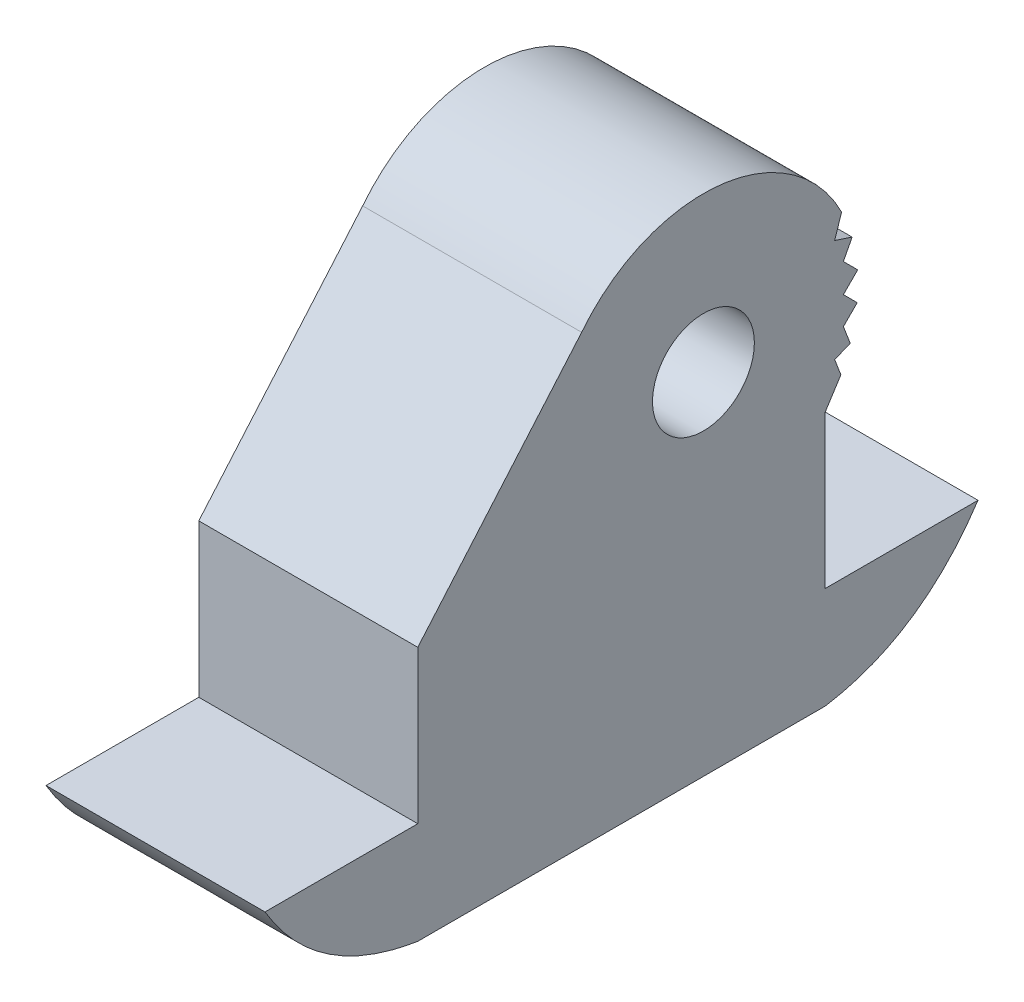
ISO-10303-21;
HEADER;
FILE_DESCRIPTION(('STEP AP214'),'2;1');
FILE_NAME('part.step','',(''),(''),'','','');
FILE_SCHEMA(('AUTOMOTIVE_DESIGN { 1 0 10303 214 1 1 1 1 }'));
ENDSEC;
DATA;
#1=APPLICATION_CONTEXT('core data for automotive mechanical design processes');
#2=APPLICATION_PROTOCOL_DEFINITION('international standard','automotive_design',2000,#1);
#3=PRODUCT_CONTEXT('',#1,'mechanical');
#4=PRODUCT('Part','Part','',(#3));
#5=PRODUCT_RELATED_PRODUCT_CATEGORY('part','',(#4));
#6=PRODUCT_DEFINITION_FORMATION('','',#4);
#7=PRODUCT_DEFINITION_CONTEXT('part definition',#1,'design');
#8=PRODUCT_DEFINITION('design','',#6,#7);
#9=PRODUCT_DEFINITION_SHAPE('','',#8);
#10=(LENGTH_UNIT() NAMED_UNIT(*) SI_UNIT(.MILLI.,.METRE.));
#11=(NAMED_UNIT(*) PLANE_ANGLE_UNIT() SI_UNIT($,.RADIAN.));
#12=(NAMED_UNIT(*) SI_UNIT($,.STERADIAN.) SOLID_ANGLE_UNIT());
#13=UNCERTAINTY_MEASURE_WITH_UNIT(LENGTH_MEASURE(1.E-05),#10,'distance_accuracy_value','');
#14=(GEOMETRIC_REPRESENTATION_CONTEXT(3) GLOBAL_UNCERTAINTY_ASSIGNED_CONTEXT((#13)) GLOBAL_UNIT_ASSIGNED_CONTEXT((#10,
#11,#12)) REPRESENTATION_CONTEXT('',''));
#15=CARTESIAN_POINT('',(0.,0.,0.));
#16=DIRECTION('',(0.,0.,1.));
#17=DIRECTION('',(1.,0.,0.));
#18=AXIS2_PLACEMENT_3D('',#15,#16,#17);
#19=CARTESIAN_POINT('',(-2.15,5.,-4.));
#20=DIRECTION('',(0.,0.,1.));
#21=DIRECTION('',(1.,0.,0.));
#22=AXIS2_PLACEMENT_3D('',#19,#20,#21);
#23=PLANE('',#22);
#24=DIRECTION('',(1.,0.,0.));
#25=VECTOR('',#24,1.);
#26=CARTESIAN_POINT('',(-5.75555127546399,2.,-4.));
#27=LINE('',#26,#25);
#28=CARTESIAN_POINT('',(-2.15,2.,-4.));
#29=VERTEX_POINT('',#28);
#30=CARTESIAN_POINT('',(2.15,2.,-4.));
#31=VERTEX_POINT('',#30);
#32=EDGE_CURVE('E55',#29,#31,#27,.T.);
#33=ORIENTED_EDGE('',*,*,#32,.F.);
#34=DIRECTION('',(0.,-1.,0.));
#35=VECTOR('',#34,1.);
#36=CARTESIAN_POINT('',(-2.15,5.,-4.));
#37=LINE('',#36,#35);
#38=CARTESIAN_POINT('',(-2.15,5.,-4.));
#39=VERTEX_POINT('',#38);
#40=EDGE_CURVE('E49',#39,#29,#37,.T.);
#41=ORIENTED_EDGE('',*,*,#40,.F.);
#42=DIRECTION('',(-1.,0.,0.));
#43=VECTOR('',#42,1.);
#44=CARTESIAN_POINT('',(-2.15,5.,-4.));
#45=LINE('',#44,#43);
#46=CARTESIAN_POINT('',(2.15,5.,-4.));
#47=VERTEX_POINT('',#46);
#48=EDGE_CURVE('E341',#47,#39,#45,.T.);
#49=ORIENTED_EDGE('',*,*,#48,.F.);
#50=DIRECTION('',(0.,-1.,0.));
#51=VECTOR('',#50,1.);
#52=CARTESIAN_POINT('',(2.15,5.,-4.));
#53=LINE('',#52,#51);
#54=EDGE_CURVE('E11',#47,#31,#53,.T.);
#55=ORIENTED_EDGE('',*,*,#54,.T.);
#56=EDGE_LOOP('',(#33,#41,#49,#55));
#57=FACE_BOUND('',#56,.T.);
#58=ADVANCED_FACE('F41',(#57),#23,.F.);
#59=CARTESIAN_POINT('',(2.15,5.,-4.));
#60=DIRECTION('',(-1.,0.,0.));
#61=DIRECTION('',(0.,0.,1.));
#62=AXIS2_PLACEMENT_3D('',#59,#60,#61);
#63=PLANE('',#62);
#64=DIRECTION('',(0.,0.,-1.));
#65=VECTOR('',#64,1.);
#66=CARTESIAN_POINT('',(2.15,0.,-4.));
#67=LINE('',#66,#65);
#68=CARTESIAN_POINT('',(2.15,0.,4.));
#69=VERTEX_POINT('',#68);
#70=CARTESIAN_POINT('',(2.15,0.,-4.));
#71=VERTEX_POINT('',#70);
#72=EDGE_CURVE('E340',#69,#71,#67,.T.);
#73=ORIENTED_EDGE('',*,*,#72,.T.);
#74=CARTESIAN_POINT('',(2.15,0.,-4.));
#75=CARTESIAN_POINT('',(2.15,0.295991092707208,-5.86881420991045));
#76=CARTESIAN_POINT('',(2.15,2.,-7.));
#77=B_SPLINE_CURVE_WITH_KNOTS('',2,(#74,#75,#76),.UNSPECIFIED.,.F.,.F.,(3,3),(0.,1.),.UNSPECIFIED.);
#78=CARTESIAN_POINT('',(2.15,2.,-7.));
#79=VERTEX_POINT('',#78);
#80=EDGE_CURVE('E280',#71,#79,#77,.T.);
#81=ORIENTED_EDGE('',*,*,#80,.T.);
#82=DIRECTION('',(0.,0.,1.));
#83=VECTOR('',#82,1.);
#84=CARTESIAN_POINT('',(2.15,2.,-4.));
#85=LINE('',#84,#83);
#86=EDGE_CURVE('E277',#79,#31,#85,.T.);
#87=ORIENTED_EDGE('',*,*,#86,.T.);
#88=ORIENTED_EDGE('',*,*,#54,.F.);
#89=DIRECTION('',(0.,0.841553339065543,-0.540174025206355));
#90=VECTOR('',#89,1.);
#91=CARTESIAN_POINT('',(2.15,5.47996911176551,-4.30808130042593));
#92=LINE('',#91,#90);
#93=CARTESIAN_POINT('',(2.15,5.47996911176551,-4.30808130042593));
#94=VERTEX_POINT('',#93);
#95=EDGE_CURVE('E184',#47,#94,#92,.T.);
#96=ORIENTED_EDGE('',*,*,#95,.T.);
#97=DIRECTION('',(0.,0.933817176744675,0.357750584089814));
#98=VECTOR('',#97,1.);
#99=CARTESIAN_POINT('',(2.15,5.80148797690143,-4.18490562464831));
#100=LINE('',#99,#98);
#101=CARTESIAN_POINT('',(2.15,5.80148797690143,-4.18490562464831));
#102=VERTEX_POINT('',#101);
#103=EDGE_CURVE('E193',#94,#102,#100,.T.);
#104=ORIENTED_EDGE('',*,*,#103,.T.);
#105=DIRECTION('',(0.,0.357750584089813,-0.933817176744676));
#106=VECTOR('',#105,1.);
#107=CARTESIAN_POINT('',(2.15,5.91948539690457,-4.49290796625408));
#108=LINE('',#107,#106);
#109=CARTESIAN_POINT('',(2.15,5.91948539690457,-4.49290796625408));
#110=VERTEX_POINT('',#109);
#111=EDGE_CURVE('E199',#102,#110,#108,.T.);
#112=ORIENTED_EDGE('',*,*,#111,.T.);
#113=DIRECTION('',(0.,0.933817176744676,0.357750584089813));
#114=VECTOR('',#113,1.);
#115=CARTESIAN_POINT('',(2.15,6.27457062281251,-4.35687282989788));
#116=LINE('',#115,#114);
#117=CARTESIAN_POINT('',(2.15,6.27457062281251,-4.35687282989788));
#118=VERTEX_POINT('',#117);
#119=EDGE_CURVE('E212',#110,#118,#116,.T.);
#120=ORIENTED_EDGE('',*,*,#119,.T.);
#121=DIRECTION('',(0.,0.706411155567094,-0.707801723147354));
#122=VECTOR('',#121,1.);
#123=CARTESIAN_POINT('',(2.15,6.54610637845833,-4.62894310261029));
#124=LINE('',#123,#122);
#125=CARTESIAN_POINT('',(2.15,6.54610637845833,-4.62894310261029));
#126=VERTEX_POINT('',#125);
#127=EDGE_CURVE('E215',#118,#126,#124,.T.);
#128=ORIENTED_EDGE('',*,*,#127,.T.);
#129=DIRECTION('',(0.,0.707801723147358,0.70641115556709));
#130=VECTOR('',#129,1.);
#131=CARTESIAN_POINT('',(2.15,6.81871222043208,-4.35687282989787));
#132=LINE('',#131,#130);
#133=CARTESIAN_POINT('',(2.15,6.81871222043208,-4.35687282989787));
#134=VERTEX_POINT('',#133);
#135=EDGE_CURVE('E218',#126,#134,#132,.T.);
#136=ORIENTED_EDGE('',*,*,#135,.T.);
#137=DIRECTION('',(0.,0.706411155567095,-0.707801723147352));
#138=VECTOR('',#137,1.);
#139=CARTESIAN_POINT('',(2.15,7.09953270220437,-4.6382461056836));
#140=LINE('',#139,#138);
#141=CARTESIAN_POINT('',(2.15,7.09953270220437,-4.6382461056836));
#142=VERTEX_POINT('',#141);
#143=EDGE_CURVE('E221',#134,#142,#140,.T.);
#144=ORIENTED_EDGE('',*,*,#143,.T.);
#145=DIRECTION('',(0.,0.707801723147357,0.70641115556709));
#146=VECTOR('',#145,1.);
#147=CARTESIAN_POINT('',(2.15,7.38145986017638,-4.35687282989787));
#148=LINE('',#147,#146);
#149=CARTESIAN_POINT('',(2.15,7.38145986017638,-4.35687282989787));
#150=VERTEX_POINT('',#149);
#151=EDGE_CURVE('E224',#142,#150,#148,.T.);
#152=ORIENTED_EDGE('',*,*,#151,.T.);
#153=DIRECTION('',(0.,0.886815065357864,-0.462124485235665));
#154=VECTOR('',#153,1.);
#155=CARTESIAN_POINT('',(2.15,7.7114642491129,-4.52884003514743));
#156=LINE('',#155,#154);
#157=CARTESIAN_POINT('',(2.15,7.7114642491129,-4.52884003514743));
#158=VERTEX_POINT('',#157);
#159=EDGE_CURVE('E227',#150,#158,#156,.T.);
#160=ORIENTED_EDGE('',*,*,#159,.T.);
#161=DIRECTION('',(0.,0.313872790344998,0.949465044896886));
#162=VECTOR('',#161,1.);
#163=CARTESIAN_POINT('',(2.15,7.8251615923687,-4.18490562464831));
#164=LINE('',#163,#162);
#165=CARTESIAN_POINT('',(2.15,7.8251615923687,-4.18490562464831));
#166=VERTEX_POINT('',#165);
#167=EDGE_CURVE('E230',#158,#166,#164,.T.);
#168=ORIENTED_EDGE('',*,*,#167,.T.);
#169=DIRECTION('',(0.,0.949465044896885,-0.313872790344998));
#170=VECTOR('',#169,1.);
#171=CARTESIAN_POINT('',(2.15,8.23998936776822,-4.32203879461288));
#172=LINE('',#171,#170);
#173=CARTESIAN_POINT('',(2.15,8.23998936776822,-4.32203879461288));
#174=VERTEX_POINT('',#173);
#175=EDGE_CURVE('E233',#166,#174,#172,.T.);
#176=ORIENTED_EDGE('',*,*,#175,.T.);
#177=CARTESIAN_POINT('',(2.15,6.87366445419573,-1.60888166582021));
#178=DIRECTION('',(1.,0.,0.));
#179=DIRECTION('',(0.,0.,1.));
#180=AXIS2_PLACEMENT_3D('',#177,#178,#179);
#181=CIRCLE('',#180,3.03777309471384);
#182=CARTESIAN_POINT('',(2.15,8.74732890839147,0.782236668359575));
#183=VERTEX_POINT('',#182);
#184=EDGE_CURVE('E236',#174,#183,#181,.T.);
#185=ORIENTED_EDGE('',*,*,#184,.T.);
#186=DIRECTION('',(0.,-0.758679369993663,0.651464207417429));
#187=VECTOR('',#186,1.);
#188=CARTESIAN_POINT('',(2.15,5.,4.));
#189=LINE('',#188,#187);
#190=CARTESIAN_POINT('',(2.15,5.,4.));
#191=VERTEX_POINT('',#190);
#192=EDGE_CURVE('E190',#183,#191,#189,.T.);
#193=ORIENTED_EDGE('',*,*,#192,.T.);
#194=DIRECTION('',(0.,-1.,0.));
#195=VECTOR('',#194,1.);
#196=CARTESIAN_POINT('',(2.15,5.,4.));
#197=LINE('',#196,#195);
#198=CARTESIAN_POINT('',(2.15,2.,4.));
#199=VERTEX_POINT('',#198);
#200=EDGE_CURVE('E347',#191,#199,#197,.T.);
#201=ORIENTED_EDGE('',*,*,#200,.T.);
#202=DIRECTION('',(0.,0.,1.));
#203=VECTOR('',#202,1.);
#204=CARTESIAN_POINT('',(2.15,2.,4.));
#205=LINE('',#204,#203);
#206=CARTESIAN_POINT('',(2.15,2.,7.));
#207=VERTEX_POINT('',#206);
#208=EDGE_CURVE('E63',#199,#207,#205,.T.);
#209=ORIENTED_EDGE('',*,*,#208,.T.);
#210=CARTESIAN_POINT('',(2.15,2.,7.));
#211=CARTESIAN_POINT('',(2.15,0.317190085835391,6.00265938488311));
#212=CARTESIAN_POINT('',(2.15,0.,4.));
#213=B_SPLINE_CURVE_WITH_KNOTS('',2,(#210,#211,#212),.UNSPECIFIED.,.F.,.F.,(3,3),(0.,1.),.UNSPECIFIED.);
#214=EDGE_CURVE('E326',#207,#69,#213,.T.);
#215=ORIENTED_EDGE('',*,*,#214,.T.);
#216=EDGE_LOOP('',(#73,#81,#87,#88,#96,#104,#112,#120,#128,#136,#144,#152,#160,#168,#176,#185,
#193,#201,#209,#215));
#217=FACE_BOUND('',#216,.T.);
#218=CARTESIAN_POINT('',(2.15,6.87366445419573,-1.60888166582021));
#219=DIRECTION('',(1.,0.,0.));
#220=DIRECTION('',(0.,0.,-1.));
#221=AXIS2_PLACEMENT_3D('',#218,#219,#220);
#222=CIRCLE('',#221,1.);
#223=CARTESIAN_POINT('',(2.15,6.87366445419573,-2.60888166582021));
#224=VERTEX_POINT('',#223);
#225=EDGE_CURVE('E205',#224,#224,#222,.T.);
#226=ORIENTED_EDGE('',*,*,#225,.F.);
#227=EDGE_LOOP('',(#226));
#228=FACE_BOUND('',#227,.T.);
#229=ADVANCED_FACE('F43',(#217,#228),#63,.F.);
#230=CARTESIAN_POINT('',(-2.15,5.,-4.));
#231=DIRECTION('',(1.,0.,0.));
#232=DIRECTION('',(0.,0.,-1.));
#233=AXIS2_PLACEMENT_3D('',#230,#231,#232);
#234=PLANE('',#233);
#235=DIRECTION('',(0.,0.,1.));
#236=VECTOR('',#235,1.);
#237=CARTESIAN_POINT('',(-2.15,0.,-4.));
#238=LINE('',#237,#236);
#239=CARTESIAN_POINT('',(-2.15,0.,-4.));
#240=VERTEX_POINT('',#239);
#241=CARTESIAN_POINT('',(-2.15,0.,4.));
#242=VERTEX_POINT('',#241);
#243=EDGE_CURVE('E352',#240,#242,#238,.T.);
#244=ORIENTED_EDGE('',*,*,#243,.T.);
#245=CARTESIAN_POINT('',(-2.15,2.,7.));
#246=CARTESIAN_POINT('',(-2.15,0.317190085835391,6.00265938488311));
#247=CARTESIAN_POINT('',(-2.15,0.,4.));
#248=B_SPLINE_CURVE_WITH_KNOTS('',2,(#245,#246,#247),.UNSPECIFIED.,.F.,.F.,(3,3),(0.,1.),.UNSPECIFIED.);
#249=CARTESIAN_POINT('',(-2.15,2.,7.));
#250=VERTEX_POINT('',#249);
#251=EDGE_CURVE('E319',#242,#250,#248,.F.);
#252=ORIENTED_EDGE('',*,*,#251,.T.);
#253=DIRECTION('',(0.,0.,-1.));
#254=VECTOR('',#253,1.);
#255=CARTESIAN_POINT('',(-2.15,2.,4.));
#256=LINE('',#255,#254);
#257=CARTESIAN_POINT('',(-2.15,2.,4.));
#258=VERTEX_POINT('',#257);
#259=EDGE_CURVE('E338',#250,#258,#256,.T.);
#260=ORIENTED_EDGE('',*,*,#259,.T.);
#261=DIRECTION('',(0.,-1.,0.));
#262=VECTOR('',#261,1.);
#263=CARTESIAN_POINT('',(-2.15,5.,4.));
#264=LINE('',#263,#262);
#265=CARTESIAN_POINT('',(-2.15,5.,4.));
#266=VERTEX_POINT('',#265);
#267=EDGE_CURVE('E358',#266,#258,#264,.T.);
#268=ORIENTED_EDGE('',*,*,#267,.F.);
#269=DIRECTION('',(0.,0.758679369993663,-0.651464207417429));
#270=VECTOR('',#269,1.);
#271=CARTESIAN_POINT('',(-2.15,5.,4.));
#272=LINE('',#271,#270);
#273=CARTESIAN_POINT('',(-2.15,8.74732890839147,0.782236668359575));
#274=VERTEX_POINT('',#273);
#275=EDGE_CURVE('E381',#266,#274,#272,.T.);
#276=ORIENTED_EDGE('',*,*,#275,.T.);
#277=CARTESIAN_POINT('',(-2.15,6.87366445419573,-1.60888166582021));
#278=DIRECTION('',(1.,0.,0.));
#279=DIRECTION('',(0.,0.,-1.));
#280=AXIS2_PLACEMENT_3D('',#277,#278,#279);
#281=CIRCLE('',#280,3.03777309471384);
#282=CARTESIAN_POINT('',(-2.15,8.23998936776822,-4.32203879461288));
#283=VERTEX_POINT('',#282);
#284=EDGE_CURVE('E383',#274,#283,#281,.F.);
#285=ORIENTED_EDGE('',*,*,#284,.T.);
#286=DIRECTION('',(0.,-0.949465044896885,0.313872790344998));
#287=VECTOR('',#286,1.);
#288=CARTESIAN_POINT('',(-2.15,8.23998936776822,-4.32203879461288));
#289=LINE('',#288,#287);
#290=CARTESIAN_POINT('',(-2.15,7.8251615923687,-4.18490562464831));
#291=VERTEX_POINT('',#290);
#292=EDGE_CURVE('E385',#283,#291,#289,.T.);
#293=ORIENTED_EDGE('',*,*,#292,.T.);
#294=DIRECTION('',(0.,-0.313872790344998,-0.949465044896886));
#295=VECTOR('',#294,1.);
#296=CARTESIAN_POINT('',(-2.15,7.8251615923687,-4.18490562464831));
#297=LINE('',#296,#295);
#298=CARTESIAN_POINT('',(-2.15,7.7114642491129,-4.52884003514743));
#299=VERTEX_POINT('',#298);
#300=EDGE_CURVE('E389',#291,#299,#297,.T.);
#301=ORIENTED_EDGE('',*,*,#300,.T.);
#302=DIRECTION('',(0.,-0.886815065357864,0.462124485235665));
#303=VECTOR('',#302,1.);
#304=CARTESIAN_POINT('',(-2.15,7.7114642491129,-4.52884003514743));
#305=LINE('',#304,#303);
#306=CARTESIAN_POINT('',(-2.15,7.38145986017638,-4.35687282989787));
#307=VERTEX_POINT('',#306);
#308=EDGE_CURVE('E391',#299,#307,#305,.T.);
#309=ORIENTED_EDGE('',*,*,#308,.T.);
#310=DIRECTION('',(0.,-0.707801723147357,-0.70641115556709));
#311=VECTOR('',#310,1.);
#312=CARTESIAN_POINT('',(-2.15,7.38145986017638,-4.35687282989787));
#313=LINE('',#312,#311);
#314=CARTESIAN_POINT('',(-2.15,7.09953270220437,-4.6382461056836));
#315=VERTEX_POINT('',#314);
#316=EDGE_CURVE('E393',#307,#315,#313,.T.);
#317=ORIENTED_EDGE('',*,*,#316,.T.);
#318=DIRECTION('',(0.,-0.706411155567095,0.707801723147352));
#319=VECTOR('',#318,1.);
#320=CARTESIAN_POINT('',(-2.15,7.09953270220437,-4.6382461056836));
#321=LINE('',#320,#319);
#322=CARTESIAN_POINT('',(-2.15,6.81871222043208,-4.35687282989787));
#323=VERTEX_POINT('',#322);
#324=EDGE_CURVE('E395',#315,#323,#321,.T.);
#325=ORIENTED_EDGE('',*,*,#324,.T.);
#326=DIRECTION('',(0.,-0.707801723147358,-0.70641115556709));
#327=VECTOR('',#326,1.);
#328=CARTESIAN_POINT('',(-2.15,6.81871222043208,-4.35687282989787));
#329=LINE('',#328,#327);
#330=CARTESIAN_POINT('',(-2.15,6.54610637845833,-4.62894310261029));
#331=VERTEX_POINT('',#330);
#332=EDGE_CURVE('E397',#323,#331,#329,.T.);
#333=ORIENTED_EDGE('',*,*,#332,.T.);
#334=DIRECTION('',(0.,-0.706411155567093,0.707801723147354));
#335=VECTOR('',#334,1.);
#336=CARTESIAN_POINT('',(-2.15,6.54610637845833,-4.62894310261029));
#337=LINE('',#336,#335);
#338=CARTESIAN_POINT('',(-2.15,6.27457062281251,-4.35687282989787));
#339=VERTEX_POINT('',#338);
#340=EDGE_CURVE('E399',#331,#339,#337,.T.);
#341=ORIENTED_EDGE('',*,*,#340,.T.);
#342=DIRECTION('',(0.,-0.933817176744676,-0.357750584089813));
#343=VECTOR('',#342,1.);
#344=CARTESIAN_POINT('',(-2.15,6.27457062281251,-4.35687282989787));
#345=LINE('',#344,#343);
#346=CARTESIAN_POINT('',(-2.15,5.91948539690457,-4.49290796625408));
#347=VERTEX_POINT('',#346);
#348=EDGE_CURVE('E401',#339,#347,#345,.T.);
#349=ORIENTED_EDGE('',*,*,#348,.T.);
#350=DIRECTION('',(0.,-0.357750584089813,0.933817176744676));
#351=VECTOR('',#350,1.);
#352=CARTESIAN_POINT('',(-2.15,5.91948539690457,-4.49290796625408));
#353=LINE('',#352,#351);
#354=CARTESIAN_POINT('',(-2.15,5.80148797690143,-4.18490562464831));
#355=VERTEX_POINT('',#354);
#356=EDGE_CURVE('E403',#347,#355,#353,.T.);
#357=ORIENTED_EDGE('',*,*,#356,.T.);
#358=DIRECTION('',(0.,-0.933817176744675,-0.357750584089815));
#359=VECTOR('',#358,1.);
#360=CARTESIAN_POINT('',(-2.15,5.80148797690143,-4.18490562464831));
#361=LINE('',#360,#359);
#362=CARTESIAN_POINT('',(-2.15,5.47996911176551,-4.30808130042592));
#363=VERTEX_POINT('',#362);
#364=EDGE_CURVE('E243',#355,#363,#361,.T.);
#365=ORIENTED_EDGE('',*,*,#364,.T.);
#366=DIRECTION('',(0.,-0.841553339065543,0.540174025206355));
#367=VECTOR('',#366,1.);
#368=CARTESIAN_POINT('',(-2.15,5.47996911176551,-4.30808130042592));
#369=LINE('',#368,#367);
#370=EDGE_CURVE('E186',#363,#39,#369,.T.);
#371=ORIENTED_EDGE('',*,*,#370,.T.);
#372=ORIENTED_EDGE('',*,*,#40,.T.);
#373=DIRECTION('',(0.,0.,-1.));
#374=VECTOR('',#373,1.);
#375=CARTESIAN_POINT('',(-2.15,2.,-4.));
#376=LINE('',#375,#374);
#377=CARTESIAN_POINT('',(-2.15,2.,-7.));
#378=VERTEX_POINT('',#377);
#379=EDGE_CURVE('E271',#29,#378,#376,.T.);
#380=ORIENTED_EDGE('',*,*,#379,.T.);
#381=CARTESIAN_POINT('',(-2.15,0.,-4.));
#382=CARTESIAN_POINT('',(-2.15,0.295991092707208,-5.86881420991045));
#383=CARTESIAN_POINT('',(-2.15,2.,-7.));
#384=B_SPLINE_CURVE_WITH_KNOTS('',2,(#381,#382,#383),.UNSPECIFIED.,.F.,.F.,(3,3),(0.,1.),.UNSPECIFIED.);
#385=EDGE_CURVE('E266',#378,#240,#384,.F.);
#386=ORIENTED_EDGE('',*,*,#385,.T.);
#387=EDGE_LOOP('',(#244,#252,#260,#268,#276,#285,#293,#301,#309,#317,#325,#333,#341,#349,#357,
#365,#371,#372,#380,#386));
#388=FACE_BOUND('',#387,.T.);
#389=CARTESIAN_POINT('',(-2.15,6.87366445419573,-1.60888166582021));
#390=DIRECTION('',(1.,0.,0.));
#391=DIRECTION('',(0.,0.,-1.));
#392=AXIS2_PLACEMENT_3D('',#389,#390,#391);
#393=CIRCLE('',#392,1.);
#394=CARTESIAN_POINT('',(-2.15,6.87366445419573,-2.60888166582021));
#395=VERTEX_POINT('',#394);
#396=EDGE_CURVE('E263',#395,#395,#393,.F.);
#397=ORIENTED_EDGE('',*,*,#396,.F.);
#398=EDGE_LOOP('',(#397));
#399=FACE_BOUND('',#398,.T.);
#400=ADVANCED_FACE('F362',(#388,#399),#234,.F.);
#401=CARTESIAN_POINT('',(-2.15,5.,4.));
#402=DIRECTION('',(0.,0.,-1.));
#403=DIRECTION('',(-1.,0.,0.));
#404=AXIS2_PLACEMENT_3D('',#401,#402,#403);
#405=PLANE('',#404);
#406=ORIENTED_EDGE('',*,*,#267,.T.);
#407=DIRECTION('',(1.,0.,0.));
#408=VECTOR('',#407,1.);
#409=CARTESIAN_POINT('',(-5.75555127546399,2.,4.));
#410=LINE('',#409,#408);
#411=EDGE_CURVE('E331',#258,#199,#410,.T.);
#412=ORIENTED_EDGE('',*,*,#411,.T.);
#413=ORIENTED_EDGE('',*,*,#200,.F.);
#414=DIRECTION('',(1.,0.,0.));
#415=VECTOR('',#414,1.);
#416=CARTESIAN_POINT('',(-2.15,5.,4.));
#417=LINE('',#416,#415);
#418=EDGE_CURVE('E343',#266,#191,#417,.T.);
#419=ORIENTED_EDGE('',*,*,#418,.F.);
#420=EDGE_LOOP('',(#406,#412,#413,#419));
#421=FACE_BOUND('',#420,.T.);
#422=ADVANCED_FACE('F376',(#421),#405,.F.);
#423=CARTESIAN_POINT('',(0.,0.,0.));
#424=DIRECTION('',(0.,1.,0.));
#425=DIRECTION('',(0.,0.,1.));
#426=AXIS2_PLACEMENT_3D('',#423,#424,#425);
#427=PLANE('',#426);
#428=ORIENTED_EDGE('',*,*,#72,.F.);
#429=DIRECTION('',(1.,0.,0.));
#430=VECTOR('',#429,1.);
#431=CARTESIAN_POINT('',(-2.15,0.,4.));
#432=LINE('',#431,#430);
#433=EDGE_CURVE('E344',#242,#69,#432,.T.);
#434=ORIENTED_EDGE('',*,*,#433,.F.);
#435=ORIENTED_EDGE('',*,*,#243,.F.);
#436=DIRECTION('',(-1.,0.,0.));
#437=VECTOR('',#436,1.);
#438=CARTESIAN_POINT('',(-2.15,0.,-4.));
#439=LINE('',#438,#437);
#440=EDGE_CURVE('E349',#71,#240,#439,.T.);
#441=ORIENTED_EDGE('',*,*,#440,.F.);
#442=EDGE_LOOP('',(#428,#434,#435,#441));
#443=FACE_BOUND('',#442,.T.);
#444=ADVANCED_FACE('F312',(#443),#427,.F.);
#445=CARTESIAN_POINT('',(-5.75555127546399,2.,7.));
#446=CARTESIAN_POINT('',(-5.75555127546399,0.317190085835391,6.00265938488311));
#447=CARTESIAN_POINT('',(-5.75555127546399,0.,4.));
#448=B_SPLINE_CURVE_WITH_KNOTS('',2,(#445,#446,#447),.UNSPECIFIED.,.F.,.F.,(3,3),(0.,1.),.UNSPECIFIED.);
#449=DIRECTION('',(1.,0.,0.));
#450=VECTOR('',#449,1.);
#451=SURFACE_OF_LINEAR_EXTRUSION('',#448,#450);
#452=ORIENTED_EDGE('',*,*,#251,.F.);
#453=ORIENTED_EDGE('',*,*,#433,.T.);
#454=ORIENTED_EDGE('',*,*,#214,.F.);
#455=DIRECTION('',(1.,0.,0.));
#456=VECTOR('',#455,1.);
#457=CARTESIAN_POINT('',(-5.75555127546399,2.,7.));
#458=LINE('',#457,#456);
#459=EDGE_CURVE('E332',#250,#207,#458,.T.);
#460=ORIENTED_EDGE('',*,*,#459,.F.);
#461=EDGE_LOOP('',(#452,#453,#454,#460));
#462=FACE_BOUND('',#461,.T.);
#463=ADVANCED_FACE('F308',(#462),#451,.T.);
#464=CARTESIAN_POINT('',(-5.75555127546399,2.,4.));
#465=DIRECTION('',(0.,1.,0.));
#466=DIRECTION('',(0.,0.,1.));
#467=AXIS2_PLACEMENT_3D('',#464,#465,#466);
#468=PLANE('',#467);
#469=ORIENTED_EDGE('',*,*,#259,.F.);
#470=ORIENTED_EDGE('',*,*,#459,.T.);
#471=ORIENTED_EDGE('',*,*,#208,.F.);
#472=ORIENTED_EDGE('',*,*,#411,.F.);
#473=EDGE_LOOP('',(#469,#470,#471,#472));
#474=FACE_BOUND('',#473,.T.);
#475=ADVANCED_FACE('F306',(#474),#468,.T.);
#476=CARTESIAN_POINT('',(-5.75555127546399,2.,-4.));
#477=DIRECTION('',(0.,1.,0.));
#478=DIRECTION('',(0.,0.,1.));
#479=AXIS2_PLACEMENT_3D('',#476,#477,#478);
#480=PLANE('',#479);
#481=ORIENTED_EDGE('',*,*,#379,.F.);
#482=ORIENTED_EDGE('',*,*,#32,.T.);
#483=ORIENTED_EDGE('',*,*,#86,.F.);
#484=DIRECTION('',(1.,0.,0.));
#485=VECTOR('',#484,1.);
#486=CARTESIAN_POINT('',(-5.75555127546399,2.,-7.));
#487=LINE('',#486,#485);
#488=EDGE_CURVE('E272',#378,#79,#487,.T.);
#489=ORIENTED_EDGE('',*,*,#488,.F.);
#490=EDGE_LOOP('',(#481,#482,#483,#489));
#491=FACE_BOUND('',#490,.T.);
#492=ADVANCED_FACE('F301',(#491),#480,.T.);
#493=CARTESIAN_POINT('',(-5.75555127546399,0.,-4.));
#494=CARTESIAN_POINT('',(-5.75555127546399,0.295991092707208,-5.86881420991045));
#495=CARTESIAN_POINT('',(-5.75555127546399,2.,-7.));
#496=B_SPLINE_CURVE_WITH_KNOTS('',2,(#493,#494,#495),.UNSPECIFIED.,.F.,.F.,(3,3),(0.,1.),.UNSPECIFIED.);
#497=DIRECTION('',(1.,0.,0.));
#498=VECTOR('',#497,1.);
#499=SURFACE_OF_LINEAR_EXTRUSION('',#496,#498);
#500=ORIENTED_EDGE('',*,*,#385,.F.);
#501=ORIENTED_EDGE('',*,*,#488,.T.);
#502=ORIENTED_EDGE('',*,*,#80,.F.);
#503=ORIENTED_EDGE('',*,*,#440,.T.);
#504=EDGE_LOOP('',(#500,#501,#502,#503));
#505=FACE_BOUND('',#504,.T.);
#506=ADVANCED_FACE('F297',(#505),#499,.T.);
#507=CARTESIAN_POINT('',(-12.0868765001482,5.47996911176551,-4.30808130042592));
#508=DIRECTION('',(0.,-0.540174025206355,-0.841553339065543));
#509=DIRECTION('',(0.,0.841553339065543,-0.540174025206355));
#510=AXIS2_PLACEMENT_3D('',#507,#508,#509);
#511=PLANE('',#510);
#512=ORIENTED_EDGE('',*,*,#370,.F.);
#513=DIRECTION('',(1.,0.,0.));
#514=VECTOR('',#513,1.);
#515=CARTESIAN_POINT('',(-12.0868765001482,5.47996911176551,-4.30808130042592));
#516=LINE('',#515,#514);
#517=EDGE_CURVE('E179',#363,#94,#516,.T.);
#518=ORIENTED_EDGE('',*,*,#517,.T.);
#519=ORIENTED_EDGE('',*,*,#95,.F.);
#520=ORIENTED_EDGE('',*,*,#48,.T.);
#521=EDGE_LOOP('',(#512,#518,#519,#520));
#522=FACE_BOUND('',#521,.T.);
#523=ADVANCED_FACE('F181',(#522),#511,.T.);
#524=CARTESIAN_POINT('',(-12.0868765001482,5.80148797690143,-4.18490562464831));
#525=DIRECTION('',(0.,0.357750584089815,-0.933817176744675));
#526=DIRECTION('',(0.,0.933817176744675,0.357750584089815));
#527=AXIS2_PLACEMENT_3D('',#524,#525,#526);
#528=PLANE('',#527);
#529=ORIENTED_EDGE('',*,*,#364,.F.);
#530=DIRECTION('',(1.,0.,0.));
#531=VECTOR('',#530,1.);
#532=CARTESIAN_POINT('',(-12.0868765001482,5.80148797690143,-4.18490562464831));
#533=LINE('',#532,#531);
#534=EDGE_CURVE('E189',#355,#102,#533,.T.);
#535=ORIENTED_EDGE('',*,*,#534,.T.);
#536=ORIENTED_EDGE('',*,*,#103,.F.);
#537=ORIENTED_EDGE('',*,*,#517,.F.);
#538=EDGE_LOOP('',(#529,#535,#536,#537));
#539=FACE_BOUND('',#538,.T.);
#540=ADVANCED_FACE('F194',(#539),#528,.T.);
#541=CARTESIAN_POINT('',(-12.0868765001482,5.91948539690457,-4.49290796625408));
#542=DIRECTION('',(0.,-0.933817176744676,-0.357750584089813));
#543=DIRECTION('',(0.,0.357750584089813,-0.933817176744676));
#544=AXIS2_PLACEMENT_3D('',#541,#542,#543);
#545=PLANE('',#544);
#546=ORIENTED_EDGE('',*,*,#356,.F.);
#547=DIRECTION('',(1.,0.,0.));
#548=VECTOR('',#547,1.);
#549=CARTESIAN_POINT('',(-12.0868765001482,5.91948539690457,-4.49290796625408));
#550=LINE('',#549,#548);
#551=EDGE_CURVE('E260',#347,#110,#550,.T.);
#552=ORIENTED_EDGE('',*,*,#551,.T.);
#553=ORIENTED_EDGE('',*,*,#111,.F.);
#554=ORIENTED_EDGE('',*,*,#534,.F.);
#555=EDGE_LOOP('',(#546,#552,#553,#554));
#556=FACE_BOUND('',#555,.T.);
#557=ADVANCED_FACE('F407',(#556),#545,.T.);
#558=CARTESIAN_POINT('',(-12.0868765001482,6.27457062281251,-4.35687282989787));
#559=DIRECTION('',(0.,0.357750584089813,-0.933817176744676));
#560=DIRECTION('',(0.,0.933817176744676,0.357750584089813));
#561=AXIS2_PLACEMENT_3D('',#558,#559,#560);
#562=PLANE('',#561);
#563=ORIENTED_EDGE('',*,*,#348,.F.);
#564=DIRECTION('',(1.,0.,0.));
#565=VECTOR('',#564,1.);
#566=CARTESIAN_POINT('',(-12.0868765001482,6.27457062281251,-4.35687282989787));
#567=LINE('',#566,#565);
#568=EDGE_CURVE('E258',#339,#118,#567,.T.);
#569=ORIENTED_EDGE('',*,*,#568,.T.);
#570=ORIENTED_EDGE('',*,*,#119,.F.);
#571=ORIENTED_EDGE('',*,*,#551,.F.);
#572=EDGE_LOOP('',(#563,#569,#570,#571));
#573=FACE_BOUND('',#572,.T.);
#574=ADVANCED_FACE('F413',(#573),#562,.T.);
#575=CARTESIAN_POINT('',(-12.0868765001482,6.54610637845833,-4.62894310261029));
#576=DIRECTION('',(0.,-0.707801723147354,-0.706411155567093));
#577=DIRECTION('',(0.,0.706411155567093,-0.707801723147354));
#578=AXIS2_PLACEMENT_3D('',#575,#576,#577);
#579=PLANE('',#578);
#580=ORIENTED_EDGE('',*,*,#340,.F.);
#581=DIRECTION('',(1.,0.,0.));
#582=VECTOR('',#581,1.);
#583=CARTESIAN_POINT('',(-12.0868765001482,6.54610637845833,-4.62894310261029));
#584=LINE('',#583,#582);
#585=EDGE_CURVE('E256',#331,#126,#584,.T.);
#586=ORIENTED_EDGE('',*,*,#585,.T.);
#587=ORIENTED_EDGE('',*,*,#127,.F.);
#588=ORIENTED_EDGE('',*,*,#568,.F.);
#589=EDGE_LOOP('',(#580,#586,#587,#588));
#590=FACE_BOUND('',#589,.T.);
#591=ADVANCED_FACE('F417',(#590),#579,.T.);
#592=CARTESIAN_POINT('',(-12.0868765001482,6.81871222043208,-4.35687282989787));
#593=DIRECTION('',(0.,0.70641115556709,-0.707801723147358));
#594=DIRECTION('',(0.,0.707801723147358,0.70641115556709));
#595=AXIS2_PLACEMENT_3D('',#592,#593,#594);
#596=PLANE('',#595);
#597=ORIENTED_EDGE('',*,*,#332,.F.);
#598=DIRECTION('',(1.,0.,0.));
#599=VECTOR('',#598,1.);
#600=CARTESIAN_POINT('',(-12.0868765001482,6.81871222043208,-4.35687282989787));
#601=LINE('',#600,#599);
#602=EDGE_CURVE('E254',#323,#134,#601,.T.);
#603=ORIENTED_EDGE('',*,*,#602,.T.);
#604=ORIENTED_EDGE('',*,*,#135,.F.);
#605=ORIENTED_EDGE('',*,*,#585,.F.);
#606=EDGE_LOOP('',(#597,#603,#604,#605));
#607=FACE_BOUND('',#606,.T.);
#608=ADVANCED_FACE('F422',(#607),#596,.T.);
#609=CARTESIAN_POINT('',(-12.0868765001482,7.09953270220437,-4.6382461056836));
#610=DIRECTION('',(0.,-0.707801723147352,-0.706411155567095));
#611=DIRECTION('',(0.,0.706411155567095,-0.707801723147352));
#612=AXIS2_PLACEMENT_3D('',#609,#610,#611);
#613=PLANE('',#612);
#614=ORIENTED_EDGE('',*,*,#324,.F.);
#615=DIRECTION('',(1.,0.,0.));
#616=VECTOR('',#615,1.);
#617=CARTESIAN_POINT('',(-12.0868765001482,7.09953270220437,-4.6382461056836));
#618=LINE('',#617,#616);
#619=EDGE_CURVE('E252',#315,#142,#618,.T.);
#620=ORIENTED_EDGE('',*,*,#619,.T.);
#621=ORIENTED_EDGE('',*,*,#143,.F.);
#622=ORIENTED_EDGE('',*,*,#602,.F.);
#623=EDGE_LOOP('',(#614,#620,#621,#622));
#624=FACE_BOUND('',#623,.T.);
#625=ADVANCED_FACE('F428',(#624),#613,.T.);
#626=CARTESIAN_POINT('',(-12.0868765001482,7.38145986017638,-4.35687282989787));
#627=DIRECTION('',(0.,0.70641115556709,-0.707801723147357));
#628=DIRECTION('',(0.,0.707801723147357,0.70641115556709));
#629=AXIS2_PLACEMENT_3D('',#626,#627,#628);
#630=PLANE('',#629);
#631=ORIENTED_EDGE('',*,*,#316,.F.);
#632=DIRECTION('',(1.,0.,0.));
#633=VECTOR('',#632,1.);
#634=CARTESIAN_POINT('',(-12.0868765001482,7.38145986017638,-4.35687282989787));
#635=LINE('',#634,#633);
#636=EDGE_CURVE('E250',#307,#150,#635,.T.);
#637=ORIENTED_EDGE('',*,*,#636,.T.);
#638=ORIENTED_EDGE('',*,*,#151,.F.);
#639=ORIENTED_EDGE('',*,*,#619,.F.);
#640=EDGE_LOOP('',(#631,#637,#638,#639));
#641=FACE_BOUND('',#640,.T.);
#642=ADVANCED_FACE('F432',(#641),#630,.T.);
#643=CARTESIAN_POINT('',(-12.0868765001482,7.7114642491129,-4.52884003514743));
#644=DIRECTION('',(0.,-0.462124485235665,-0.886815065357863));
#645=DIRECTION('',(0.,0.886815065357864,-0.462124485235665));
#646=AXIS2_PLACEMENT_3D('',#643,#644,#645);
#647=PLANE('',#646);
#648=ORIENTED_EDGE('',*,*,#308,.F.);
#649=DIRECTION('',(1.,0.,0.));
#650=VECTOR('',#649,1.);
#651=CARTESIAN_POINT('',(-12.0868765001482,7.7114642491129,-4.52884003514743));
#652=LINE('',#651,#650);
#653=EDGE_CURVE('E248',#299,#158,#652,.T.);
#654=ORIENTED_EDGE('',*,*,#653,.T.);
#655=ORIENTED_EDGE('',*,*,#159,.F.);
#656=ORIENTED_EDGE('',*,*,#636,.F.);
#657=EDGE_LOOP('',(#648,#654,#655,#656));
#658=FACE_BOUND('',#657,.T.);
#659=ADVANCED_FACE('F437',(#658),#647,.T.);
#660=CARTESIAN_POINT('',(-12.0868765001482,7.8251615923687,-4.18490562464831));
#661=DIRECTION('',(0.,0.949465044896886,-0.313872790344998));
#662=DIRECTION('',(0.,0.313872790344998,0.949465044896886));
#663=AXIS2_PLACEMENT_3D('',#660,#661,#662);
#664=PLANE('',#663);
#665=ORIENTED_EDGE('',*,*,#300,.F.);
#666=DIRECTION('',(1.,0.,0.));
#667=VECTOR('',#666,1.);
#668=CARTESIAN_POINT('',(-12.0868765001482,7.8251615923687,-4.18490562464831));
#669=LINE('',#668,#667);
#670=EDGE_CURVE('E246',#291,#166,#669,.T.);
#671=ORIENTED_EDGE('',*,*,#670,.T.);
#672=ORIENTED_EDGE('',*,*,#167,.F.);
#673=ORIENTED_EDGE('',*,*,#653,.F.);
#674=EDGE_LOOP('',(#665,#671,#672,#673));
#675=FACE_BOUND('',#674,.T.);
#676=ADVANCED_FACE('F443',(#675),#664,.T.);
#677=CARTESIAN_POINT('',(-12.0868765001482,8.23998936776822,-4.32203879461287));
#678=DIRECTION('',(0.,-0.313872790344998,-0.949465044896885));
#679=DIRECTION('',(0.,0.949465044896885,-0.313872790344998));
#680=AXIS2_PLACEMENT_3D('',#677,#678,#679);
#681=PLANE('',#680);
#682=ORIENTED_EDGE('',*,*,#292,.F.);
#683=DIRECTION('',(1.,0.,0.));
#684=VECTOR('',#683,1.);
#685=CARTESIAN_POINT('',(-12.0868765001482,8.23998936776822,-4.32203879461287));
#686=LINE('',#685,#684);
#687=EDGE_CURVE('E244',#283,#174,#686,.T.);
#688=ORIENTED_EDGE('',*,*,#687,.T.);
#689=ORIENTED_EDGE('',*,*,#175,.F.);
#690=ORIENTED_EDGE('',*,*,#670,.F.);
#691=EDGE_LOOP('',(#682,#688,#689,#690));
#692=FACE_BOUND('',#691,.T.);
#693=ADVANCED_FACE('F447',(#692),#681,.T.);
#694=CARTESIAN_POINT('',(-12.0868765001482,6.87366445419573,-1.60888166582021));
#695=DIRECTION('',(1.,0.,0.));
#696=DIRECTION('',(0.,0.,-1.));
#697=AXIS2_PLACEMENT_3D('',#694,#695,#696);
#698=CYLINDRICAL_SURFACE('',#697,3.03777309471384);
#699=ORIENTED_EDGE('',*,*,#284,.F.);
#700=DIRECTION('',(1.,0.,0.));
#701=VECTOR('',#700,1.);
#702=CARTESIAN_POINT('',(-12.0868765001482,8.74732890839147,0.782236668359576));
#703=LINE('',#702,#701);
#704=EDGE_CURVE('E241',#274,#183,#703,.T.);
#705=ORIENTED_EDGE('',*,*,#704,.T.);
#706=ORIENTED_EDGE('',*,*,#184,.F.);
#707=ORIENTED_EDGE('',*,*,#687,.F.);
#708=EDGE_LOOP('',(#699,#705,#706,#707));
#709=FACE_BOUND('',#708,.T.);
#710=ADVANCED_FACE('F451',(#709),#698,.T.);
#711=CARTESIAN_POINT('',(-12.0868765001482,5.,4.));
#712=DIRECTION('',(0.,0.651464207417429,0.758679369993663));
#713=DIRECTION('',(0.,-0.758679369993663,0.651464207417429));
#714=AXIS2_PLACEMENT_3D('',#711,#712,#713);
#715=PLANE('',#714);
#716=ORIENTED_EDGE('',*,*,#275,.F.);
#717=ORIENTED_EDGE('',*,*,#418,.T.);
#718=ORIENTED_EDGE('',*,*,#192,.F.);
#719=ORIENTED_EDGE('',*,*,#704,.F.);
#720=EDGE_LOOP('',(#716,#717,#718,#719));
#721=FACE_BOUND('',#720,.T.);
#722=ADVANCED_FACE('F379',(#721),#715,.T.);
#723=CARTESIAN_POINT('',(-12.0868765001482,6.87366445419573,-1.60888166582021));
#724=DIRECTION('',(1.,0.,0.));
#725=DIRECTION('',(0.,0.,-1.));
#726=AXIS2_PLACEMENT_3D('',#723,#724,#725);
#727=CYLINDRICAL_SURFACE('',#726,1.);
#728=ORIENTED_EDGE('',*,*,#396,.T.);
#729=EDGE_LOOP('',(#728));
#730=FACE_BOUND('',#729,.T.);
#731=ORIENTED_EDGE('',*,*,#225,.T.);
#732=EDGE_LOOP('',(#731));
#733=FACE_BOUND('',#732,.T.);
#734=ADVANCED_FACE('F458',(#730,#733),#727,.F.);
#735=CLOSED_SHELL('',(#58,#229,#400,#422,#444,#463,#475,#492,#506,#523,#540,#557,#574,#591,#608,
#625,#642,#659,#676,#693,#710,#722,#734));
#736=MANIFOLD_SOLID_BREP('B2',#735);
#737=ADVANCED_BREP_SHAPE_REPRESENTATION('',(#18,#736),#14);
#738=SHAPE_DEFINITION_REPRESENTATION(#9,#737);
ENDSEC;
END-ISO-10303-21;
